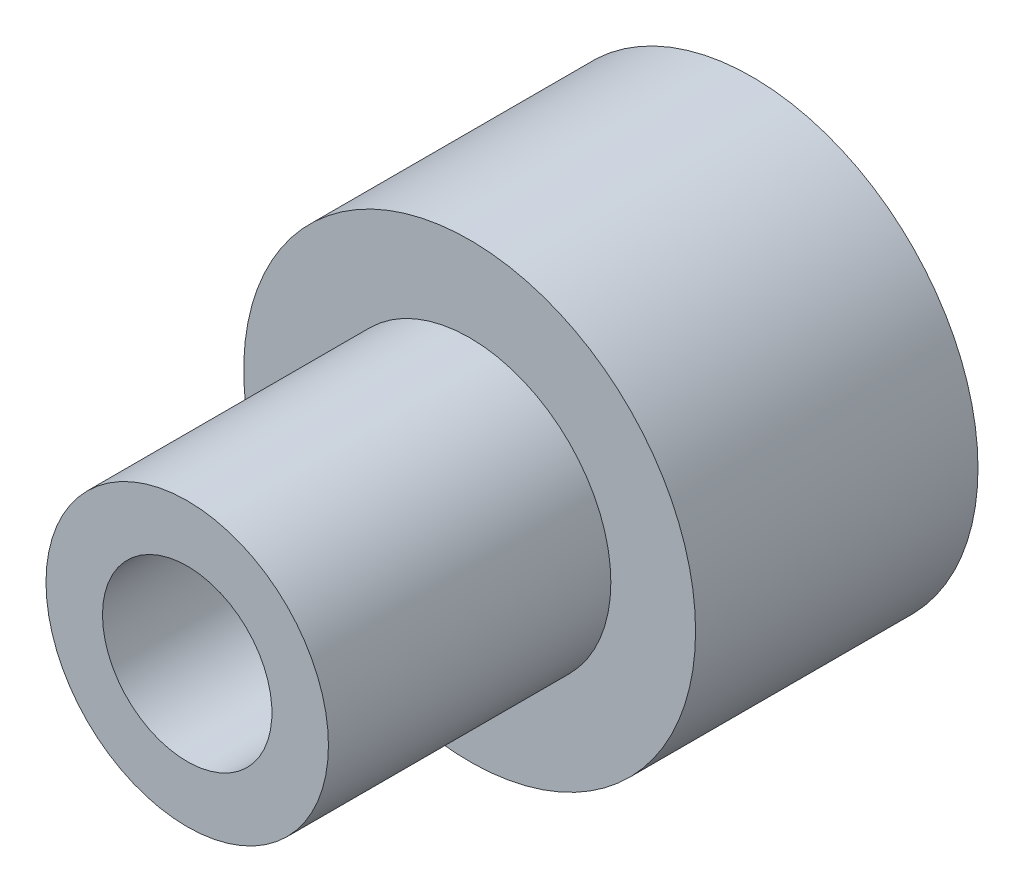
ISO-10303-21;
HEADER;
FILE_DESCRIPTION(('STEP AP214'),'2;1');
FILE_NAME('part.step','',(''),(''),'','','');
FILE_SCHEMA(('AUTOMOTIVE_DESIGN { 1 0 10303 214 1 1 1 1 }'));
ENDSEC;
DATA;
#1=APPLICATION_CONTEXT('core data for automotive mechanical design processes');
#2=APPLICATION_PROTOCOL_DEFINITION('international standard','automotive_design',2000,#1);
#3=PRODUCT_CONTEXT('',#1,'mechanical');
#4=PRODUCT('Part','Part','',(#3));
#5=PRODUCT_RELATED_PRODUCT_CATEGORY('part','',(#4));
#6=PRODUCT_DEFINITION_FORMATION('','',#4);
#7=PRODUCT_DEFINITION_CONTEXT('part definition',#1,'design');
#8=PRODUCT_DEFINITION('design','',#6,#7);
#9=PRODUCT_DEFINITION_SHAPE('','',#8);
#10=(LENGTH_UNIT() NAMED_UNIT(*) SI_UNIT(.MILLI.,.METRE.));
#11=(NAMED_UNIT(*) PLANE_ANGLE_UNIT() SI_UNIT($,.RADIAN.));
#12=(NAMED_UNIT(*) SI_UNIT($,.STERADIAN.) SOLID_ANGLE_UNIT());
#13=UNCERTAINTY_MEASURE_WITH_UNIT(LENGTH_MEASURE(1.E-05),#10,'distance_accuracy_value','');
#14=(GEOMETRIC_REPRESENTATION_CONTEXT(3) GLOBAL_UNCERTAINTY_ASSIGNED_CONTEXT((#13)) GLOBAL_UNIT_ASSIGNED_CONTEXT((#10,
#11,#12)) REPRESENTATION_CONTEXT('',''));
#15=CARTESIAN_POINT('',(0.,0.,0.));
#16=DIRECTION('',(0.,0.,1.));
#17=DIRECTION('',(1.,0.,0.));
#18=AXIS2_PLACEMENT_3D('',#15,#16,#17);
#19=CARTESIAN_POINT('',(0.,0.,5.));
#20=DIRECTION('',(0.,0.,-1.));
#21=DIRECTION('',(-1.,0.,0.));
#22=AXIS2_PLACEMENT_3D('',#19,#20,#21);
#23=CYLINDRICAL_SURFACE('',#22,4.);
#24=CARTESIAN_POINT('',(0.,0.,5.));
#25=DIRECTION('',(0.,0.,1.));
#26=DIRECTION('',(1.,0.,0.));
#27=AXIS2_PLACEMENT_3D('',#24,#25,#26);
#28=CIRCLE('',#27,4.);
#29=CARTESIAN_POINT('',(4.,0.,5.));
#30=VERTEX_POINT('',#29);
#31=EDGE_CURVE('E37',#30,#30,#28,.T.);
#32=ORIENTED_EDGE('',*,*,#31,.F.);
#33=EDGE_LOOP('',(#32));
#34=FACE_BOUND('',#33,.T.);
#35=CARTESIAN_POINT('',(0.,0.,0.));
#36=DIRECTION('',(0.,0.,1.));
#37=DIRECTION('',(1.,0.,0.));
#38=AXIS2_PLACEMENT_3D('',#35,#36,#37);
#39=CIRCLE('',#38,4.);
#40=CARTESIAN_POINT('',(4.,0.,0.));
#41=VERTEX_POINT('',#40);
#42=EDGE_CURVE('E33',#41,#41,#39,.T.);
#43=ORIENTED_EDGE('',*,*,#42,.T.);
#44=EDGE_LOOP('',(#43));
#45=FACE_BOUND('',#44,.T.);
#46=ADVANCED_FACE('F30',(#34,#45),#23,.T.);
#47=CARTESIAN_POINT('',(0.,0.,5.));
#48=DIRECTION('',(0.,0.,1.));
#49=DIRECTION('',(1.,0.,0.));
#50=AXIS2_PLACEMENT_3D('',#47,#48,#49);
#51=PLANE('',#50);
#52=CARTESIAN_POINT('',(0.,0.,5.));
#53=DIRECTION('',(0.,0.,1.));
#54=DIRECTION('',(1.,0.,0.));
#55=AXIS2_PLACEMENT_3D('',#52,#53,#54);
#56=CIRCLE('',#55,2.5);
#57=CARTESIAN_POINT('',(2.5,0.,5.));
#58=VERTEX_POINT('',#57);
#59=EDGE_CURVE('E10',#58,#58,#56,.T.);
#60=ORIENTED_EDGE('',*,*,#59,.F.);
#61=EDGE_LOOP('',(#60));
#62=FACE_BOUND('',#61,.T.);
#63=ORIENTED_EDGE('',*,*,#31,.T.);
#64=EDGE_LOOP('',(#63));
#65=FACE_BOUND('',#64,.T.);
#66=ADVANCED_FACE('F66',(#62,#65),#51,.T.);
#67=CARTESIAN_POINT('',(0.,0.,0.));
#68=DIRECTION('',(0.,0.,1.));
#69=DIRECTION('',(1.,0.,0.));
#70=AXIS2_PLACEMENT_3D('',#67,#68,#69);
#71=PLANE('',#70);
#72=CARTESIAN_POINT('',(0.,0.,0.));
#73=DIRECTION('',(0.,0.,-1.));
#74=DIRECTION('',(-1.,0.,0.));
#75=AXIS2_PLACEMENT_3D('',#72,#73,#74);
#76=CIRCLE('',#75,1.5);
#77=CARTESIAN_POINT('',(-1.5,0.,0.));
#78=VERTEX_POINT('',#77);
#79=EDGE_CURVE('E47',#78,#78,#76,.T.);
#80=ORIENTED_EDGE('',*,*,#79,.F.);
#81=EDGE_LOOP('',(#80));
#82=FACE_BOUND('',#81,.T.);
#83=ORIENTED_EDGE('',*,*,#42,.F.);
#84=EDGE_LOOP('',(#83));
#85=FACE_BOUND('',#84,.T.);
#86=ADVANCED_FACE('F62',(#82,#85),#71,.F.);
#87=CARTESIAN_POINT('',(0.,0.,10.));
#88=DIRECTION('',(0.,0.,-1.));
#89=DIRECTION('',(-1.,0.,0.));
#90=AXIS2_PLACEMENT_3D('',#87,#88,#89);
#91=CYLINDRICAL_SURFACE('',#90,2.5);
#92=CARTESIAN_POINT('',(0.,0.,10.));
#93=DIRECTION('',(0.,0.,1.));
#94=DIRECTION('',(1.,0.,0.));
#95=AXIS2_PLACEMENT_3D('',#92,#93,#94);
#96=CIRCLE('',#95,2.5);
#97=CARTESIAN_POINT('',(2.5,0.,10.));
#98=VERTEX_POINT('',#97);
#99=EDGE_CURVE('E43',#98,#98,#96,.T.);
#100=ORIENTED_EDGE('',*,*,#99,.F.);
#101=EDGE_LOOP('',(#100));
#102=FACE_BOUND('',#101,.T.);
#103=ORIENTED_EDGE('',*,*,#59,.T.);
#104=EDGE_LOOP('',(#103));
#105=FACE_BOUND('',#104,.T.);
#106=ADVANCED_FACE('F65',(#102,#105),#91,.T.);
#107=CARTESIAN_POINT('',(0.,0.,10.));
#108=DIRECTION('',(0.,0.,1.));
#109=DIRECTION('',(1.,0.,0.));
#110=AXIS2_PLACEMENT_3D('',#107,#108,#109);
#111=PLANE('',#110);
#112=CARTESIAN_POINT('',(0.,0.,10.));
#113=DIRECTION('',(0.,0.,-1.));
#114=DIRECTION('',(-1.,0.,0.));
#115=AXIS2_PLACEMENT_3D('',#112,#113,#114);
#116=CIRCLE('',#115,1.5);
#117=CARTESIAN_POINT('',(-1.5,0.,10.));
#118=VERTEX_POINT('',#117);
#119=EDGE_CURVE('E46',#118,#118,#116,.T.);
#120=ORIENTED_EDGE('',*,*,#119,.T.);
#121=EDGE_LOOP('',(#120));
#122=FACE_BOUND('',#121,.T.);
#123=ORIENTED_EDGE('',*,*,#99,.T.);
#124=EDGE_LOOP('',(#123));
#125=FACE_BOUND('',#124,.T.);
#126=ADVANCED_FACE('F53',(#122,#125),#111,.T.);
#127=CARTESIAN_POINT('',(0.,0.,10.));
#128=DIRECTION('',(0.,0.,-1.));
#129=DIRECTION('',(-1.,0.,0.));
#130=AXIS2_PLACEMENT_3D('',#127,#128,#129);
#131=CYLINDRICAL_SURFACE('',#130,1.5);
#132=ORIENTED_EDGE('',*,*,#119,.F.);
#133=EDGE_LOOP('',(#132));
#134=FACE_BOUND('',#133,.T.);
#135=ORIENTED_EDGE('',*,*,#79,.T.);
#136=EDGE_LOOP('',(#135));
#137=FACE_BOUND('',#136,.T.);
#138=ADVANCED_FACE('F56',(#134,#137),#131,.F.);
#139=CLOSED_SHELL('',(#46,#66,#86,#106,#126,#138));
#140=MANIFOLD_SOLID_BREP('B2',#139);
#141=ADVANCED_BREP_SHAPE_REPRESENTATION('',(#18,#140),#14);
#142=SHAPE_DEFINITION_REPRESENTATION(#9,#141);
ENDSEC;
END-ISO-10303-21;
